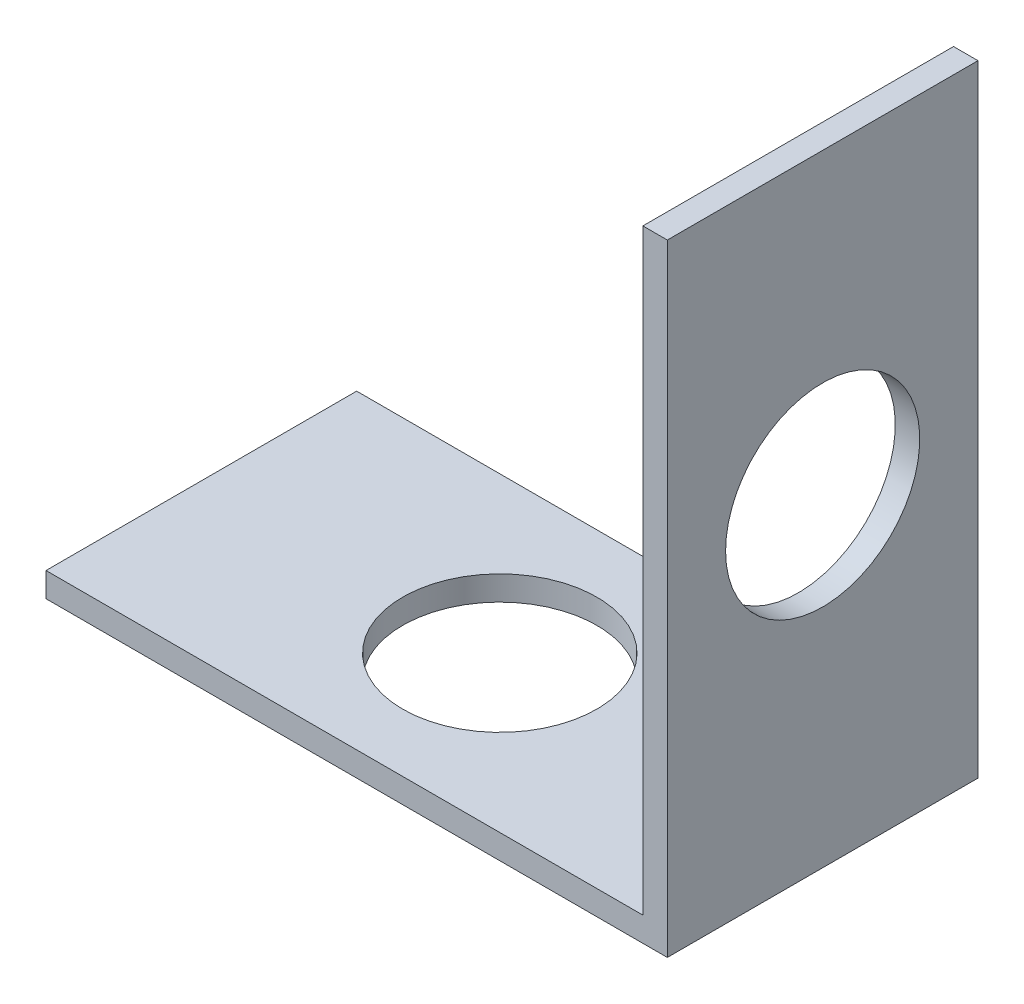
ISO-10303-21;
HEADER;
FILE_DESCRIPTION(('STEP AP214'),'2;1');
FILE_NAME('part.step','',(''),(''),'','','');
FILE_SCHEMA(('AUTOMOTIVE_DESIGN { 1 0 10303 214 1 1 1 1 }'));
ENDSEC;
DATA;
#1=APPLICATION_CONTEXT('core data for automotive mechanical design processes');
#2=APPLICATION_PROTOCOL_DEFINITION('international standard','automotive_design',2000,#1);
#3=PRODUCT_CONTEXT('',#1,'mechanical');
#4=PRODUCT('Part','Part','',(#3));
#5=PRODUCT_RELATED_PRODUCT_CATEGORY('part','',(#4));
#6=PRODUCT_DEFINITION_FORMATION('','',#4);
#7=PRODUCT_DEFINITION_CONTEXT('part definition',#1,'design');
#8=PRODUCT_DEFINITION('design','',#6,#7);
#9=PRODUCT_DEFINITION_SHAPE('','',#8);
#10=(LENGTH_UNIT() NAMED_UNIT(*) SI_UNIT(.MILLI.,.METRE.));
#11=(NAMED_UNIT(*) PLANE_ANGLE_UNIT() SI_UNIT($,.RADIAN.));
#12=(NAMED_UNIT(*) SI_UNIT($,.STERADIAN.) SOLID_ANGLE_UNIT());
#13=UNCERTAINTY_MEASURE_WITH_UNIT(LENGTH_MEASURE(1.E-05),#10,'distance_accuracy_value','');
#14=(GEOMETRIC_REPRESENTATION_CONTEXT(3) GLOBAL_UNCERTAINTY_ASSIGNED_CONTEXT((#13)) GLOBAL_UNIT_ASSIGNED_CONTEXT((#10,
#11,#12)) REPRESENTATION_CONTEXT('',''));
#15=CARTESIAN_POINT('',(0.,0.,0.));
#16=DIRECTION('',(0.,0.,1.));
#17=DIRECTION('',(1.,0.,0.));
#18=AXIS2_PLACEMENT_3D('',#15,#16,#17);
#19=CARTESIAN_POINT('',(-1.,1.,6.35));
#20=DIRECTION('',(1.,0.,0.));
#21=DIRECTION('',(0.,0.,-1.));
#22=AXIS2_PLACEMENT_3D('',#19,#20,#21);
#23=PLANE('',#22);
#24=DIRECTION('',(0.,-1.,0.));
#25=VECTOR('',#24,1.);
#26=CARTESIAN_POINT('',(-1.,1.,-6.35));
#27=LINE('',#26,#25);
#28=CARTESIAN_POINT('',(-1.,25.4,-6.35));
#29=VERTEX_POINT('',#28);
#30=CARTESIAN_POINT('',(-1.,1.,-6.35));
#31=VERTEX_POINT('',#30);
#32=EDGE_CURVE('E122',#29,#31,#27,.T.);
#33=ORIENTED_EDGE('',*,*,#32,.T.);
#34=DIRECTION('',(0.,0.,-1.));
#35=VECTOR('',#34,1.);
#36=CARTESIAN_POINT('',(-1.,1.,6.35));
#37=LINE('',#36,#35);
#38=CARTESIAN_POINT('',(-1.,1.,6.35));
#39=VERTEX_POINT('',#38);
#40=EDGE_CURVE('E119',#39,#31,#37,.T.);
#41=ORIENTED_EDGE('',*,*,#40,.F.);
#42=DIRECTION('',(0.,-1.,0.));
#43=VECTOR('',#42,1.);
#44=CARTESIAN_POINT('',(-1.,1.,6.35));
#45=LINE('',#44,#43);
#46=CARTESIAN_POINT('',(-1.,25.4,6.35));
#47=VERTEX_POINT('',#46);
#48=EDGE_CURVE('E107',#47,#39,#45,.T.);
#49=ORIENTED_EDGE('',*,*,#48,.F.);
#50=DIRECTION('',(0.,0.,-1.));
#51=VECTOR('',#50,1.);
#52=CARTESIAN_POINT('',(-1.,25.4,6.35));
#53=LINE('',#52,#51);
#54=EDGE_CURVE('E124',#47,#29,#53,.T.);
#55=ORIENTED_EDGE('',*,*,#54,.T.);
#56=EDGE_LOOP('',(#33,#41,#49,#55));
#57=FACE_BOUND('',#56,.T.);
#58=CARTESIAN_POINT('',(-1.,13.2,0.));
#59=DIRECTION('',(-1.,0.,0.));
#60=DIRECTION('',(0.,0.,1.));
#61=AXIS2_PLACEMENT_3D('',#58,#59,#60);
#62=CIRCLE('',#61,3.96875);
#63=CARTESIAN_POINT('',(-1.,13.2,3.96875));
#64=VERTEX_POINT('',#63);
#65=EDGE_CURVE('E197',#64,#64,#62,.T.);
#66=ORIENTED_EDGE('',*,*,#65,.F.);
#67=EDGE_LOOP('',(#66));
#68=FACE_BOUND('',#67,.T.);
#69=ADVANCED_FACE('F45',(#57,#68),#23,.F.);
#70=CARTESIAN_POINT('',(0.,0.,6.35));
#71=DIRECTION('',(0.,1.,0.));
#72=DIRECTION('',(-1.,0.,0.));
#73=AXIS2_PLACEMENT_3D('',#70,#71,#72);
#74=PLANE('',#73);
#75=CARTESIAN_POINT('',(-13.2,0.,0.));
#76=DIRECTION('',(0.,1.,0.));
#77=DIRECTION('',(0.,0.,1.));
#78=AXIS2_PLACEMENT_3D('',#75,#76,#77);
#79=CIRCLE('',#78,3.96875);
#80=CARTESIAN_POINT('',(-13.2,0.,3.96875));
#81=VERTEX_POINT('',#80);
#82=EDGE_CURVE('E201',#81,#81,#79,.T.);
#83=ORIENTED_EDGE('',*,*,#82,.T.);
#84=EDGE_LOOP('',(#83));
#85=FACE_BOUND('',#84,.T.);
#86=DIRECTION('',(1.,0.,0.));
#87=VECTOR('',#86,1.);
#88=CARTESIAN_POINT('',(0.,0.,-6.35));
#89=LINE('',#88,#87);
#90=CARTESIAN_POINT('',(-25.4,0.,-6.35));
#91=VERTEX_POINT('',#90);
#92=CARTESIAN_POINT('',(0.,0.,-6.35));
#93=VERTEX_POINT('',#92);
#94=EDGE_CURVE('E135',#91,#93,#89,.T.);
#95=ORIENTED_EDGE('',*,*,#94,.T.);
#96=DIRECTION('',(0.,0.,-1.));
#97=VECTOR('',#96,1.);
#98=CARTESIAN_POINT('',(0.,0.,6.35));
#99=LINE('',#98,#97);
#100=CARTESIAN_POINT('',(0.,0.,6.35));
#101=VERTEX_POINT('',#100);
#102=EDGE_CURVE('E11',#101,#93,#99,.T.);
#103=ORIENTED_EDGE('',*,*,#102,.F.);
#104=DIRECTION('',(1.,0.,0.));
#105=VECTOR('',#104,1.);
#106=CARTESIAN_POINT('',(0.,0.,6.35));
#107=LINE('',#106,#105);
#108=CARTESIAN_POINT('',(-25.4,0.,6.35));
#109=VERTEX_POINT('',#108);
#110=EDGE_CURVE('E152',#109,#101,#107,.T.);
#111=ORIENTED_EDGE('',*,*,#110,.F.);
#112=DIRECTION('',(0.,0.,-1.));
#113=VECTOR('',#112,1.);
#114=CARTESIAN_POINT('',(-25.4,0.,6.35));
#115=LINE('',#114,#113);
#116=EDGE_CURVE('E131',#109,#91,#115,.T.);
#117=ORIENTED_EDGE('',*,*,#116,.T.);
#118=EDGE_LOOP('',(#95,#103,#111,#117));
#119=FACE_BOUND('',#118,.T.);
#120=ADVANCED_FACE('F47',(#85,#119),#74,.F.);
#121=CARTESIAN_POINT('',(0.,0.,6.35));
#122=DIRECTION('',(-1.,0.,0.));
#123=DIRECTION('',(0.,0.,1.));
#124=AXIS2_PLACEMENT_3D('',#121,#122,#123);
#125=PLANE('',#124);
#126=CARTESIAN_POINT('',(0.,13.2,0.));
#127=DIRECTION('',(-1.,0.,0.));
#128=DIRECTION('',(0.,0.,1.));
#129=AXIS2_PLACEMENT_3D('',#126,#127,#128);
#130=CIRCLE('',#129,3.96875);
#131=CARTESIAN_POINT('',(0.,13.2,3.96875));
#132=VERTEX_POINT('',#131);
#133=EDGE_CURVE('E140',#132,#132,#130,.T.);
#134=ORIENTED_EDGE('',*,*,#133,.T.);
#135=EDGE_LOOP('',(#134));
#136=FACE_BOUND('',#135,.T.);
#137=DIRECTION('',(0.,1.,0.));
#138=VECTOR('',#137,1.);
#139=CARTESIAN_POINT('',(0.,0.,-6.35));
#140=LINE('',#139,#138);
#141=CARTESIAN_POINT('',(0.,25.4,-6.35));
#142=VERTEX_POINT('',#141);
#143=EDGE_CURVE('E139',#93,#142,#140,.T.);
#144=ORIENTED_EDGE('',*,*,#143,.T.);
#145=DIRECTION('',(0.,0.,-1.));
#146=VECTOR('',#145,1.);
#147=CARTESIAN_POINT('',(0.,25.4,6.35));
#148=LINE('',#147,#146);
#149=CARTESIAN_POINT('',(0.,25.4,6.35));
#150=VERTEX_POINT('',#149);
#151=EDGE_CURVE('E55',#150,#142,#148,.T.);
#152=ORIENTED_EDGE('',*,*,#151,.F.);
#153=DIRECTION('',(0.,1.,0.));
#154=VECTOR('',#153,1.);
#155=CARTESIAN_POINT('',(0.,0.,6.35));
#156=LINE('',#155,#154);
#157=EDGE_CURVE('E100',#101,#150,#156,.T.);
#158=ORIENTED_EDGE('',*,*,#157,.F.);
#159=ORIENTED_EDGE('',*,*,#102,.T.);
#160=EDGE_LOOP('',(#144,#152,#158,#159));
#161=FACE_BOUND('',#160,.T.);
#162=ADVANCED_FACE('F185',(#136,#161),#125,.F.);
#163=CARTESIAN_POINT('',(-1.,25.4,6.35));
#164=DIRECTION('',(0.,-1.,0.));
#165=DIRECTION('',(0.,0.,-1.));
#166=AXIS2_PLACEMENT_3D('',#163,#164,#165);
#167=PLANE('',#166);
#168=DIRECTION('',(-1.,0.,0.));
#169=VECTOR('',#168,1.);
#170=CARTESIAN_POINT('',(-1.,25.4,-6.35));
#171=LINE('',#170,#169);
#172=EDGE_CURVE('E143',#142,#29,#171,.T.);
#173=ORIENTED_EDGE('',*,*,#172,.T.);
#174=ORIENTED_EDGE('',*,*,#54,.F.);
#175=DIRECTION('',(-1.,0.,0.));
#176=VECTOR('',#175,1.);
#177=CARTESIAN_POINT('',(-1.,25.4,6.35));
#178=LINE('',#177,#176);
#179=EDGE_CURVE('E113',#150,#47,#178,.T.);
#180=ORIENTED_EDGE('',*,*,#179,.F.);
#181=ORIENTED_EDGE('',*,*,#151,.T.);
#182=EDGE_LOOP('',(#173,#174,#180,#181));
#183=FACE_BOUND('',#182,.T.);
#184=ADVANCED_FACE('F162',(#183),#167,.F.);
#185=CARTESIAN_POINT('',(-1.,1.,6.35));
#186=DIRECTION('',(0.,-1.,0.));
#187=DIRECTION('',(1.,0.,0.));
#188=AXIS2_PLACEMENT_3D('',#185,#186,#187);
#189=PLANE('',#188);
#190=CARTESIAN_POINT('',(-13.2,1.,0.));
#191=DIRECTION('',(0.,1.,0.));
#192=DIRECTION('',(0.,0.,1.));
#193=AXIS2_PLACEMENT_3D('',#190,#191,#192);
#194=CIRCLE('',#193,3.96874999999999);
#195=CARTESIAN_POINT('',(-13.2,1.,3.96874999999999));
#196=VERTEX_POINT('',#195);
#197=EDGE_CURVE('E212',#196,#196,#194,.T.);
#198=ORIENTED_EDGE('',*,*,#197,.F.);
#199=EDGE_LOOP('',(#198));
#200=FACE_BOUND('',#199,.T.);
#201=DIRECTION('',(-1.,0.,0.));
#202=VECTOR('',#201,1.);
#203=CARTESIAN_POINT('',(-1.,1.,-6.35));
#204=LINE('',#203,#202);
#205=CARTESIAN_POINT('',(-25.4,0.999999999999997,-6.35));
#206=VERTEX_POINT('',#205);
#207=EDGE_CURVE('E86',#31,#206,#204,.T.);
#208=ORIENTED_EDGE('',*,*,#207,.T.);
#209=DIRECTION('',(0.,0.,-1.));
#210=VECTOR('',#209,1.);
#211=CARTESIAN_POINT('',(-25.4,0.999999999999997,6.35));
#212=LINE('',#211,#210);
#213=CARTESIAN_POINT('',(-25.4,0.999999999999997,6.35));
#214=VERTEX_POINT('',#213);
#215=EDGE_CURVE('E125',#214,#206,#212,.T.);
#216=ORIENTED_EDGE('',*,*,#215,.F.);
#217=DIRECTION('',(-1.,0.,0.));
#218=VECTOR('',#217,1.);
#219=CARTESIAN_POINT('',(-1.,1.,6.35));
#220=LINE('',#219,#218);
#221=EDGE_CURVE('E111',#39,#214,#220,.T.);
#222=ORIENTED_EDGE('',*,*,#221,.F.);
#223=ORIENTED_EDGE('',*,*,#40,.T.);
#224=EDGE_LOOP('',(#208,#216,#222,#223));
#225=FACE_BOUND('',#224,.T.);
#226=ADVANCED_FACE('F127',(#200,#225),#189,.F.);
#227=CARTESIAN_POINT('',(-25.4,0.999999999999997,6.35));
#228=DIRECTION('',(1.,0.,0.));
#229=DIRECTION('',(0.,0.,-1.));
#230=AXIS2_PLACEMENT_3D('',#227,#228,#229);
#231=PLANE('',#230);
#232=DIRECTION('',(0.,-1.,0.));
#233=VECTOR('',#232,1.);
#234=CARTESIAN_POINT('',(-25.4,0.999999999999997,-6.35));
#235=LINE('',#234,#233);
#236=EDGE_CURVE('E92',#206,#91,#235,.T.);
#237=ORIENTED_EDGE('',*,*,#236,.T.);
#238=ORIENTED_EDGE('',*,*,#116,.F.);
#239=DIRECTION('',(0.,-1.,0.));
#240=VECTOR('',#239,1.);
#241=CARTESIAN_POINT('',(-25.4,0.999999999999997,6.35));
#242=LINE('',#241,#240);
#243=EDGE_CURVE('E63',#214,#109,#242,.T.);
#244=ORIENTED_EDGE('',*,*,#243,.F.);
#245=ORIENTED_EDGE('',*,*,#215,.T.);
#246=EDGE_LOOP('',(#237,#238,#244,#245));
#247=FACE_BOUND('',#246,.T.);
#248=ADVANCED_FACE('F169',(#247),#231,.F.);
#249=CARTESIAN_POINT('',(0.,0.,6.35));
#250=DIRECTION('',(0.,0.,1.));
#251=DIRECTION('',(1.,0.,0.));
#252=AXIS2_PLACEMENT_3D('',#249,#250,#251);
#253=PLANE('',#252);
#254=ORIENTED_EDGE('',*,*,#110,.T.);
#255=ORIENTED_EDGE('',*,*,#157,.T.);
#256=ORIENTED_EDGE('',*,*,#179,.T.);
#257=ORIENTED_EDGE('',*,*,#48,.T.);
#258=ORIENTED_EDGE('',*,*,#221,.T.);
#259=ORIENTED_EDGE('',*,*,#243,.T.);
#260=EDGE_LOOP('',(#254,#255,#256,#257,#258,#259));
#261=FACE_BOUND('',#260,.T.);
#262=ADVANCED_FACE('F109',(#261),#253,.T.);
#263=CARTESIAN_POINT('',(0.,0.,-6.35));
#264=DIRECTION('',(0.,0.,1.));
#265=DIRECTION('',(1.,0.,0.));
#266=AXIS2_PLACEMENT_3D('',#263,#264,#265);
#267=PLANE('',#266);
#268=ORIENTED_EDGE('',*,*,#94,.F.);
#269=ORIENTED_EDGE('',*,*,#236,.F.);
#270=ORIENTED_EDGE('',*,*,#207,.F.);
#271=ORIENTED_EDGE('',*,*,#32,.F.);
#272=ORIENTED_EDGE('',*,*,#172,.F.);
#273=ORIENTED_EDGE('',*,*,#143,.F.);
#274=EDGE_LOOP('',(#268,#269,#270,#271,#272,#273));
#275=FACE_BOUND('',#274,.T.);
#276=ADVANCED_FACE('F165',(#275),#267,.F.);
#277=CARTESIAN_POINT('',(-1.,13.2,0.));
#278=DIRECTION('',(-1.,0.,0.));
#279=DIRECTION('',(0.,0.,1.));
#280=AXIS2_PLACEMENT_3D('',#277,#278,#279);
#281=CYLINDRICAL_SURFACE('',#280,3.96875);
#282=ORIENTED_EDGE('',*,*,#133,.F.);
#283=EDGE_LOOP('',(#282));
#284=FACE_BOUND('',#283,.T.);
#285=ORIENTED_EDGE('',*,*,#65,.T.);
#286=EDGE_LOOP('',(#285));
#287=FACE_BOUND('',#286,.T.);
#288=ADVANCED_FACE('F219',(#284,#287),#281,.F.);
#289=CARTESIAN_POINT('',(-13.2,0.999999999999999,0.));
#290=DIRECTION('',(0.,1.,0.));
#291=DIRECTION('',(0.,0.,1.));
#292=AXIS2_PLACEMENT_3D('',#289,#290,#291);
#293=CYLINDRICAL_SURFACE('',#292,3.96874999999999);
#294=ORIENTED_EDGE('',*,*,#82,.F.);
#295=EDGE_LOOP('',(#294));
#296=FACE_BOUND('',#295,.T.);
#297=ORIENTED_EDGE('',*,*,#197,.T.);
#298=EDGE_LOOP('',(#297));
#299=FACE_BOUND('',#298,.T.);
#300=ADVANCED_FACE('F217',(#296,#299),#293,.F.);
#301=CLOSED_SHELL('',(#69,#120,#162,#184,#226,#248,#262,#276,#288,#300));
#302=MANIFOLD_SOLID_BREP('B2',#301);
#303=ADVANCED_BREP_SHAPE_REPRESENTATION('',(#18,#302),#14);
#304=SHAPE_DEFINITION_REPRESENTATION(#9,#303);
ENDSEC;
END-ISO-10303-21;
